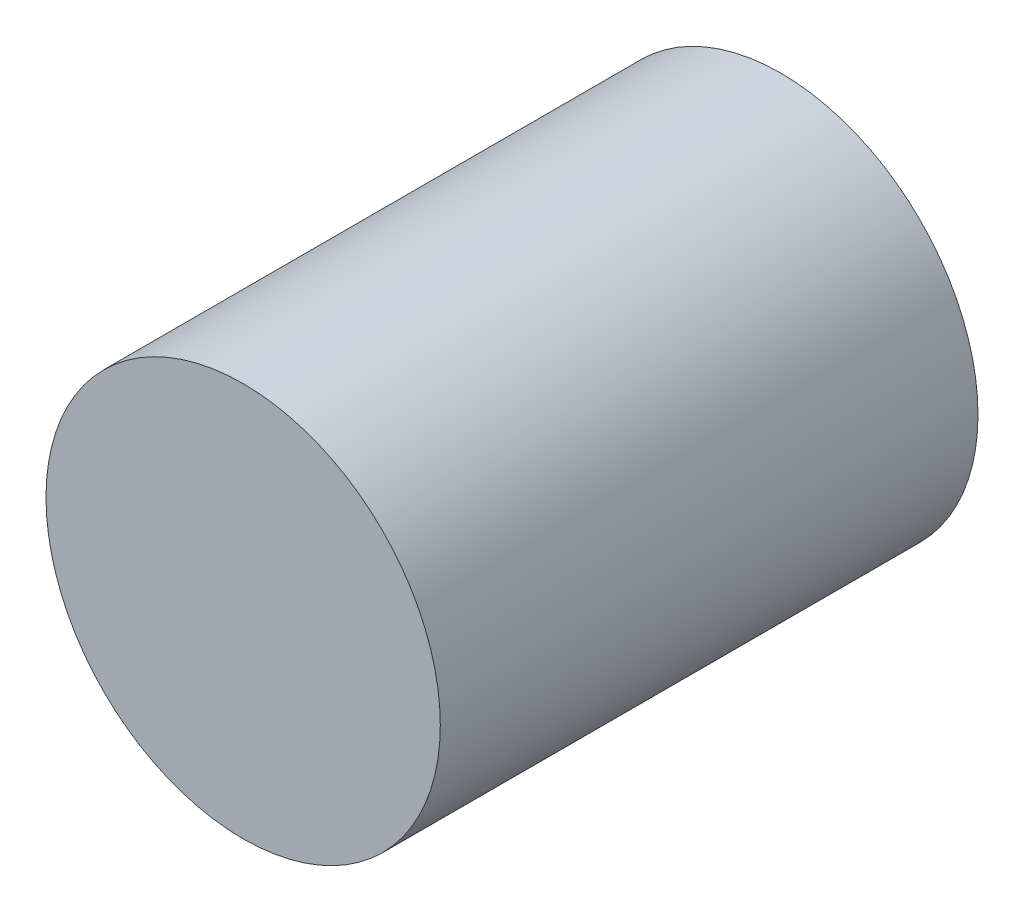
ISO-10303-21;
HEADER;
FILE_DESCRIPTION(('STEP AP214'),'2;1');
FILE_NAME('part.step','',(''),(''),'','','');
FILE_SCHEMA(('AUTOMOTIVE_DESIGN { 1 0 10303 214 1 1 1 1 }'));
ENDSEC;
DATA;
#1=APPLICATION_CONTEXT('core data for automotive mechanical design processes');
#2=APPLICATION_PROTOCOL_DEFINITION('international standard','automotive_design',2000,#1);
#3=PRODUCT_CONTEXT('',#1,'mechanical');
#4=PRODUCT('Part','Part','',(#3));
#5=PRODUCT_RELATED_PRODUCT_CATEGORY('part','',(#4));
#6=PRODUCT_DEFINITION_FORMATION('','',#4);
#7=PRODUCT_DEFINITION_CONTEXT('part definition',#1,'design');
#8=PRODUCT_DEFINITION('design','',#6,#7);
#9=PRODUCT_DEFINITION_SHAPE('','',#8);
#10=(LENGTH_UNIT() NAMED_UNIT(*) SI_UNIT(.MILLI.,.METRE.));
#11=(NAMED_UNIT(*) PLANE_ANGLE_UNIT() SI_UNIT($,.RADIAN.));
#12=(NAMED_UNIT(*) SI_UNIT($,.STERADIAN.) SOLID_ANGLE_UNIT());
#13=UNCERTAINTY_MEASURE_WITH_UNIT(LENGTH_MEASURE(1.E-05),#10,'distance_accuracy_value','');
#14=(GEOMETRIC_REPRESENTATION_CONTEXT(3) GLOBAL_UNCERTAINTY_ASSIGNED_CONTEXT((#13)) GLOBAL_UNIT_ASSIGNED_CONTEXT((#10,
#11,#12)) REPRESENTATION_CONTEXT('',''));
#15=CARTESIAN_POINT('',(0.,0.,0.));
#16=DIRECTION('',(0.,0.,1.));
#17=DIRECTION('',(1.,0.,0.));
#18=AXIS2_PLACEMENT_3D('',#15,#16,#17);
#19=CARTESIAN_POINT('',(0.,-206.1,121.78174593052));
#20=DIRECTION('',(0.,0.,-1.));
#21=DIRECTION('',(-1.,0.,0.));
#22=AXIS2_PLACEMENT_3D('',#19,#20,#21);
#23=CYLINDRICAL_SURFACE('',#22,27.5);
#24=CARTESIAN_POINT('',(0.,-206.1,44.));
#25=DIRECTION('',(0.,0.,-1.));
#26=DIRECTION('',(-1.,0.,0.));
#27=AXIS2_PLACEMENT_3D('',#24,#25,#26);
#28=CIRCLE('',#27,27.5);
#29=CARTESIAN_POINT('',(-27.5,-206.1,44.));
#30=VERTEX_POINT('',#29);
#31=EDGE_CURVE('E11',#30,#30,#28,.T.);
#32=ORIENTED_EDGE('',*,*,#31,.T.);
#33=EDGE_LOOP('',(#32));
#34=FACE_BOUND('',#33,.T.);
#35=CARTESIAN_POINT('',(0.,-206.1,-31.));
#36=DIRECTION('',(0.,0.,-1.));
#37=DIRECTION('',(-1.,0.,0.));
#38=AXIS2_PLACEMENT_3D('',#35,#36,#37);
#39=CIRCLE('',#38,27.5);
#40=CARTESIAN_POINT('',(-27.5,-206.1,-31.));
#41=VERTEX_POINT('',#40);
#42=EDGE_CURVE('E40',#41,#41,#39,.F.);
#43=ORIENTED_EDGE('',*,*,#42,.T.);
#44=EDGE_LOOP('',(#43));
#45=FACE_BOUND('',#44,.T.);
#46=ADVANCED_FACE('F33',(#34,#45),#23,.T.);
#47=CARTESIAN_POINT('',(0.,-206.1,44.));
#48=DIRECTION('',(0.,0.,-1.));
#49=DIRECTION('',(0.,1.,0.));
#50=AXIS2_PLACEMENT_3D('',#47,#48,#49);
#51=PLANE('',#50);
#52=ORIENTED_EDGE('',*,*,#31,.F.);
#53=EDGE_LOOP('',(#52));
#54=FACE_BOUND('',#53,.T.);
#55=ADVANCED_FACE('F156',(#54),#51,.F.);
#56=CARTESIAN_POINT('',(0.,-206.1,-31.));
#57=DIRECTION('',(0.,0.,-1.));
#58=DIRECTION('',(1.,0.,0.));
#59=AXIS2_PLACEMENT_3D('',#56,#57,#58);
#60=PLANE('',#59);
#61=DIRECTION('',(-0.749837855365091,0.661621637086848,0.));
#62=VECTOR('',#61,1.);
#63=CARTESIAN_POINT('',(-5.50000000000004,-221.1,-31.));
#64=LINE('',#63,#62);
#65=CARTESIAN_POINT('',(-5.50000000000004,-221.1,-31.));
#66=VERTEX_POINT('',#65);
#67=CARTESIAN_POINT('',(-22.5,-206.1,-31.));
#68=VERTEX_POINT('',#67);
#69=EDGE_CURVE('E47',#66,#68,#64,.T.);
#70=ORIENTED_EDGE('',*,*,#69,.F.);
#71=DIRECTION('',(0.,-1.,0.));
#72=VECTOR('',#71,1.);
#73=CARTESIAN_POINT('',(-5.50000000000004,-211.1,-31.));
#74=LINE('',#73,#72);
#75=CARTESIAN_POINT('',(-5.50000000000004,-211.1,-31.));
#76=VERTEX_POINT('',#75);
#77=EDGE_CURVE('E139',#76,#66,#74,.T.);
#78=ORIENTED_EDGE('',*,*,#77,.F.);
#79=DIRECTION('',(-1.,0.,0.));
#80=VECTOR('',#79,1.);
#81=CARTESIAN_POINT('',(19.5,-211.1,-31.));
#82=LINE('',#81,#80);
#83=CARTESIAN_POINT('',(19.5,-211.1,-31.));
#84=VERTEX_POINT('',#83);
#85=EDGE_CURVE('E137',#84,#76,#82,.T.);
#86=ORIENTED_EDGE('',*,*,#85,.F.);
#87=DIRECTION('',(0.,-1.,0.));
#88=VECTOR('',#87,1.);
#89=CARTESIAN_POINT('',(19.5,-201.1,-31.));
#90=LINE('',#89,#88);
#91=CARTESIAN_POINT('',(19.5,-201.1,-31.));
#92=VERTEX_POINT('',#91);
#93=EDGE_CURVE('E101',#92,#84,#90,.T.);
#94=ORIENTED_EDGE('',*,*,#93,.F.);
#95=DIRECTION('',(1.,0.,0.));
#96=VECTOR('',#95,1.);
#97=CARTESIAN_POINT('',(-5.50000000000004,-201.1,-31.));
#98=LINE('',#97,#96);
#99=CARTESIAN_POINT('',(-5.50000000000004,-201.1,-31.));
#100=VERTEX_POINT('',#99);
#101=EDGE_CURVE('E133',#100,#92,#98,.T.);
#102=ORIENTED_EDGE('',*,*,#101,.F.);
#103=DIRECTION('',(0.,-1.,0.));
#104=VECTOR('',#103,1.);
#105=CARTESIAN_POINT('',(-5.50000000000004,-191.1,-31.));
#106=LINE('',#105,#104);
#107=CARTESIAN_POINT('',(-5.50000000000004,-191.1,-31.));
#108=VERTEX_POINT('',#107);
#109=EDGE_CURVE('E130',#108,#100,#106,.T.);
#110=ORIENTED_EDGE('',*,*,#109,.F.);
#111=DIRECTION('',(0.749837855365091,0.661621637086848,0.));
#112=VECTOR('',#111,1.);
#113=CARTESIAN_POINT('',(-22.5,-206.1,-31.));
#114=LINE('',#113,#112);
#115=EDGE_CURVE('E127',#68,#108,#114,.T.);
#116=ORIENTED_EDGE('',*,*,#115,.F.);
#117=EDGE_LOOP('',(#70,#78,#86,#94,#102,#110,#116));
#118=FACE_BOUND('',#117,.T.);
#119=ORIENTED_EDGE('',*,*,#42,.F.);
#120=EDGE_LOOP('',(#119));
#121=FACE_BOUND('',#120,.T.);
#122=ADVANCED_FACE('F153',(#118,#121),#60,.T.);
#123=CARTESIAN_POINT('',(-5.50000000000004,-221.1,-21.));
#124=DIRECTION('',(-0.661621637086848,-0.749837855365091,0.));
#125=DIRECTION('',(0.749837855365091,-0.661621637086848,0.));
#126=AXIS2_PLACEMENT_3D('',#123,#124,#125);
#127=PLANE('',#126);
#128=ORIENTED_EDGE('',*,*,#69,.T.);
#129=DIRECTION('',(0.,0.,-1.));
#130=VECTOR('',#129,1.);
#131=CARTESIAN_POINT('',(-22.5,-206.1,-21.));
#132=LINE('',#131,#130);
#133=CARTESIAN_POINT('',(-22.5,-206.1,-21.));
#134=VERTEX_POINT('',#133);
#135=EDGE_CURVE('E80',#134,#68,#132,.T.);
#136=ORIENTED_EDGE('',*,*,#135,.F.);
#137=DIRECTION('',(-0.749837855365091,0.661621637086848,0.));
#138=VECTOR('',#137,1.);
#139=CARTESIAN_POINT('',(-5.50000000000004,-221.1,-21.));
#140=LINE('',#139,#138);
#141=CARTESIAN_POINT('',(-5.50000000000004,-221.1,-21.));
#142=VERTEX_POINT('',#141);
#143=EDGE_CURVE('E141',#142,#134,#140,.T.);
#144=ORIENTED_EDGE('',*,*,#143,.F.);
#145=DIRECTION('',(0.,0.,-1.));
#146=VECTOR('',#145,1.);
#147=CARTESIAN_POINT('',(-5.50000000000004,-221.1,-21.));
#148=LINE('',#147,#146);
#149=EDGE_CURVE('E55',#142,#66,#148,.T.);
#150=ORIENTED_EDGE('',*,*,#149,.T.);
#151=EDGE_LOOP('',(#128,#136,#144,#150));
#152=FACE_BOUND('',#151,.T.);
#153=ADVANCED_FACE('F155',(#152),#127,.F.);
#154=CARTESIAN_POINT('',(-5.50000000000004,-211.1,-21.));
#155=DIRECTION('',(1.,0.,0.));
#156=DIRECTION('',(0.,0.,-1.));
#157=AXIS2_PLACEMENT_3D('',#154,#155,#156);
#158=PLANE('',#157);
#159=ORIENTED_EDGE('',*,*,#77,.T.);
#160=ORIENTED_EDGE('',*,*,#149,.F.);
#161=DIRECTION('',(0.,-1.,0.));
#162=VECTOR('',#161,1.);
#163=CARTESIAN_POINT('',(-5.50000000000004,-211.1,-21.));
#164=LINE('',#163,#162);
#165=CARTESIAN_POINT('',(-5.50000000000004,-211.1,-21.));
#166=VERTEX_POINT('',#165);
#167=EDGE_CURVE('E113',#166,#142,#164,.T.);
#168=ORIENTED_EDGE('',*,*,#167,.F.);
#169=DIRECTION('',(0.,0.,-1.));
#170=VECTOR('',#169,1.);
#171=CARTESIAN_POINT('',(-5.50000000000004,-211.1,-21.));
#172=LINE('',#171,#170);
#173=EDGE_CURVE('E105',#166,#76,#172,.T.);
#174=ORIENTED_EDGE('',*,*,#173,.T.);
#175=EDGE_LOOP('',(#159,#160,#168,#174));
#176=FACE_BOUND('',#175,.T.);
#177=ADVANCED_FACE('F163',(#176),#158,.F.);
#178=CARTESIAN_POINT('',(19.5,-211.1,-21.));
#179=DIRECTION('',(0.,-1.,0.));
#180=DIRECTION('',(0.,0.,-1.));
#181=AXIS2_PLACEMENT_3D('',#178,#179,#180);
#182=PLANE('',#181);
#183=ORIENTED_EDGE('',*,*,#85,.T.);
#184=ORIENTED_EDGE('',*,*,#173,.F.);
#185=DIRECTION('',(-1.,0.,0.));
#186=VECTOR('',#185,1.);
#187=CARTESIAN_POINT('',(19.5,-211.1,-21.));
#188=LINE('',#187,#186);
#189=CARTESIAN_POINT('',(19.5,-211.1,-21.));
#190=VERTEX_POINT('',#189);
#191=EDGE_CURVE('E109',#190,#166,#188,.T.);
#192=ORIENTED_EDGE('',*,*,#191,.F.);
#193=DIRECTION('',(0.,0.,-1.));
#194=VECTOR('',#193,1.);
#195=CARTESIAN_POINT('',(19.5,-211.1,-21.));
#196=LINE('',#195,#194);
#197=EDGE_CURVE('E94',#190,#84,#196,.T.);
#198=ORIENTED_EDGE('',*,*,#197,.T.);
#199=EDGE_LOOP('',(#183,#184,#192,#198));
#200=FACE_BOUND('',#199,.T.);
#201=ADVANCED_FACE('F110',(#200),#182,.F.);
#202=CARTESIAN_POINT('',(19.5,-201.1,-21.));
#203=DIRECTION('',(1.,0.,0.));
#204=DIRECTION('',(0.,1.,0.));
#205=AXIS2_PLACEMENT_3D('',#202,#203,#204);
#206=PLANE('',#205);
#207=ORIENTED_EDGE('',*,*,#93,.T.);
#208=ORIENTED_EDGE('',*,*,#197,.F.);
#209=DIRECTION('',(0.,-1.,0.));
#210=VECTOR('',#209,1.);
#211=CARTESIAN_POINT('',(19.5,-201.1,-21.));
#212=LINE('',#211,#210);
#213=CARTESIAN_POINT('',(19.5,-201.1,-21.));
#214=VERTEX_POINT('',#213);
#215=EDGE_CURVE('E98',#214,#190,#212,.T.);
#216=ORIENTED_EDGE('',*,*,#215,.F.);
#217=DIRECTION('',(0.,0.,-1.));
#218=VECTOR('',#217,1.);
#219=CARTESIAN_POINT('',(19.5,-201.1,-21.));
#220=LINE('',#219,#218);
#221=EDGE_CURVE('E106',#214,#92,#220,.T.);
#222=ORIENTED_EDGE('',*,*,#221,.T.);
#223=EDGE_LOOP('',(#207,#208,#216,#222));
#224=FACE_BOUND('',#223,.T.);
#225=ADVANCED_FACE('F96',(#224),#206,.F.);
#226=CARTESIAN_POINT('',(-5.50000000000004,-201.1,-21.));
#227=DIRECTION('',(0.,1.,0.));
#228=DIRECTION('',(0.,0.,1.));
#229=AXIS2_PLACEMENT_3D('',#226,#227,#228);
#230=PLANE('',#229);
#231=ORIENTED_EDGE('',*,*,#101,.T.);
#232=ORIENTED_EDGE('',*,*,#221,.F.);
#233=DIRECTION('',(1.,0.,0.));
#234=VECTOR('',#233,1.);
#235=CARTESIAN_POINT('',(-5.50000000000004,-201.1,-21.));
#236=LINE('',#235,#234);
#237=CARTESIAN_POINT('',(-5.50000000000004,-201.1,-21.));
#238=VERTEX_POINT('',#237);
#239=EDGE_CURVE('E119',#238,#214,#236,.T.);
#240=ORIENTED_EDGE('',*,*,#239,.F.);
#241=DIRECTION('',(0.,0.,-1.));
#242=VECTOR('',#241,1.);
#243=CARTESIAN_POINT('',(-5.50000000000004,-201.1,-21.));
#244=LINE('',#243,#242);
#245=EDGE_CURVE('E145',#238,#100,#244,.T.);
#246=ORIENTED_EDGE('',*,*,#245,.T.);
#247=EDGE_LOOP('',(#231,#232,#240,#246));
#248=FACE_BOUND('',#247,.T.);
#249=ADVANCED_FACE('F210',(#248),#230,.F.);
#250=CARTESIAN_POINT('',(-5.50000000000004,-191.1,-21.));
#251=DIRECTION('',(1.,0.,0.));
#252=DIRECTION('',(0.,1.,0.));
#253=AXIS2_PLACEMENT_3D('',#250,#251,#252);
#254=PLANE('',#253);
#255=ORIENTED_EDGE('',*,*,#109,.T.);
#256=ORIENTED_EDGE('',*,*,#245,.F.);
#257=DIRECTION('',(0.,-1.,0.));
#258=VECTOR('',#257,1.);
#259=CARTESIAN_POINT('',(-5.50000000000004,-191.1,-21.));
#260=LINE('',#259,#258);
#261=CARTESIAN_POINT('',(-5.50000000000004,-191.1,-21.));
#262=VERTEX_POINT('',#261);
#263=EDGE_CURVE('E121',#262,#238,#260,.T.);
#264=ORIENTED_EDGE('',*,*,#263,.F.);
#265=DIRECTION('',(0.,0.,-1.));
#266=VECTOR('',#265,1.);
#267=CARTESIAN_POINT('',(-5.50000000000004,-191.1,-21.));
#268=LINE('',#267,#266);
#269=EDGE_CURVE('E147',#262,#108,#268,.T.);
#270=ORIENTED_EDGE('',*,*,#269,.T.);
#271=EDGE_LOOP('',(#255,#256,#264,#270));
#272=FACE_BOUND('',#271,.T.);
#273=ADVANCED_FACE('F219',(#272),#254,.F.);
#274=CARTESIAN_POINT('',(-22.5,-206.1,-21.));
#275=DIRECTION('',(-0.661621637086848,0.749837855365091,0.));
#276=DIRECTION('',(-0.749837855365091,-0.661621637086848,0.));
#277=AXIS2_PLACEMENT_3D('',#274,#275,#276);
#278=PLANE('',#277);
#279=ORIENTED_EDGE('',*,*,#115,.T.);
#280=ORIENTED_EDGE('',*,*,#269,.F.);
#281=DIRECTION('',(0.749837855365091,0.661621637086848,0.));
#282=VECTOR('',#281,1.);
#283=CARTESIAN_POINT('',(-22.5,-206.1,-21.));
#284=LINE('',#283,#282);
#285=EDGE_CURVE('E256',#134,#262,#284,.T.);
#286=ORIENTED_EDGE('',*,*,#285,.F.);
#287=ORIENTED_EDGE('',*,*,#135,.T.);
#288=EDGE_LOOP('',(#279,#280,#286,#287));
#289=FACE_BOUND('',#288,.T.);
#290=ADVANCED_FACE('F229',(#289),#278,.F.);
#291=CARTESIAN_POINT('',(0.,0.,-21.));
#292=DIRECTION('',(0.,0.,-1.));
#293=DIRECTION('',(-1.,0.,0.));
#294=AXIS2_PLACEMENT_3D('',#291,#292,#293);
#295=PLANE('',#294);
#296=ORIENTED_EDGE('',*,*,#143,.T.);
#297=ORIENTED_EDGE('',*,*,#285,.T.);
#298=ORIENTED_EDGE('',*,*,#263,.T.);
#299=ORIENTED_EDGE('',*,*,#239,.T.);
#300=ORIENTED_EDGE('',*,*,#215,.T.);
#301=ORIENTED_EDGE('',*,*,#191,.T.);
#302=ORIENTED_EDGE('',*,*,#167,.T.);
#303=EDGE_LOOP('',(#296,#297,#298,#299,#300,#301,#302));
#304=FACE_BOUND('',#303,.T.);
#305=ADVANCED_FACE('F116',(#304),#295,.T.);
#306=CLOSED_SHELL('',(#46,#55,#122,#153,#177,#201,#225,#249,#273,#290,#305));
#307=MANIFOLD_SOLID_BREP('B2',#306);
#308=ADVANCED_BREP_SHAPE_REPRESENTATION('',(#18,#307),#14);
#309=SHAPE_DEFINITION_REPRESENTATION(#9,#308);
ENDSEC;
END-ISO-10303-21;
